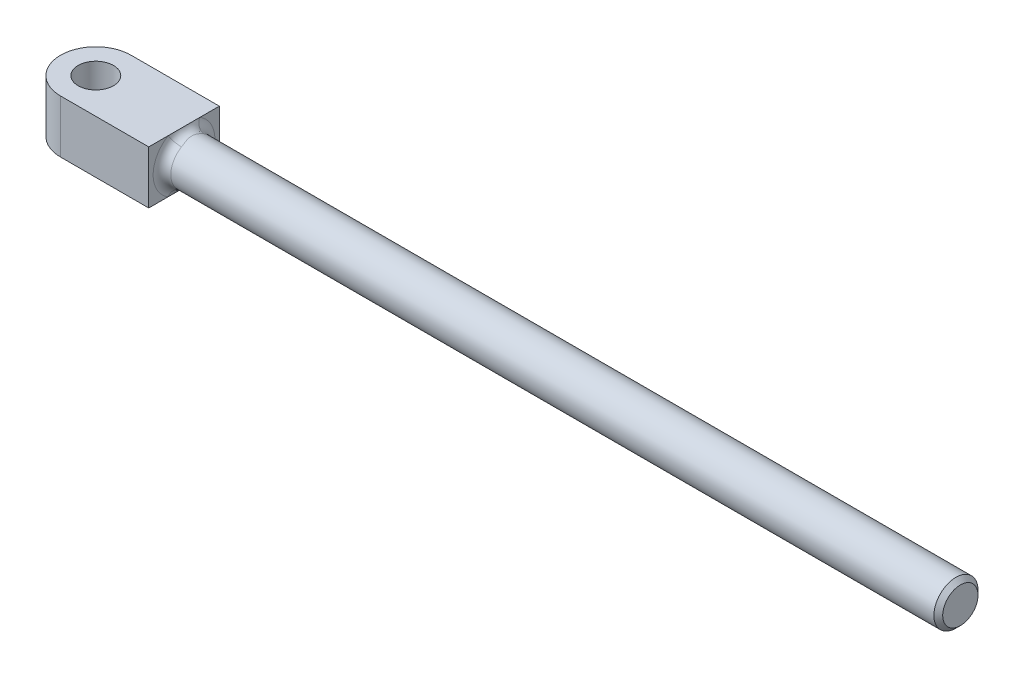
ISO-10303-21;
HEADER;
FILE_DESCRIPTION(('STEP AP214'),'2;1');
FILE_NAME('part.step','',(''),(''),'','','');
FILE_SCHEMA(('AUTOMOTIVE_DESIGN { 1 0 10303 214 1 1 1 1 }'));
ENDSEC;
DATA;
#1=APPLICATION_CONTEXT('core data for automotive mechanical design processes');
#2=APPLICATION_PROTOCOL_DEFINITION('international standard','automotive_design',2000,#1);
#3=PRODUCT_CONTEXT('',#1,'mechanical');
#4=PRODUCT('Part','Part','',(#3));
#5=PRODUCT_RELATED_PRODUCT_CATEGORY('part','',(#4));
#6=PRODUCT_DEFINITION_FORMATION('','',#4);
#7=PRODUCT_DEFINITION_CONTEXT('part definition',#1,'design');
#8=PRODUCT_DEFINITION('design','',#6,#7);
#9=PRODUCT_DEFINITION_SHAPE('','',#8);
#10=(LENGTH_UNIT() NAMED_UNIT(*) SI_UNIT(.MILLI.,.METRE.));
#11=(NAMED_UNIT(*) PLANE_ANGLE_UNIT() SI_UNIT($,.RADIAN.));
#12=(NAMED_UNIT(*) SI_UNIT($,.STERADIAN.) SOLID_ANGLE_UNIT());
#13=UNCERTAINTY_MEASURE_WITH_UNIT(LENGTH_MEASURE(1.E-05),#10,'distance_accuracy_value','');
#14=(GEOMETRIC_REPRESENTATION_CONTEXT(3) GLOBAL_UNCERTAINTY_ASSIGNED_CONTEXT((#13)) GLOBAL_UNIT_ASSIGNED_CONTEXT((#10,
#11,#12)) REPRESENTATION_CONTEXT('',''));
#15=CARTESIAN_POINT('',(0.,0.,0.));
#16=DIRECTION('',(0.,0.,1.));
#17=DIRECTION('',(1.,0.,0.));
#18=AXIS2_PLACEMENT_3D('',#15,#16,#17);
#19=CARTESIAN_POINT('',(-44.,3.,-3.99999999999999));
#20=DIRECTION('',(-1.,0.,0.));
#21=DIRECTION('',(0.,0.,1.));
#22=AXIS2_PLACEMENT_3D('',#19,#20,#21);
#23=PLANE('',#22);
#24=DIRECTION('',(0.,0.,-1.));
#25=VECTOR('',#24,1.);
#26=CARTESIAN_POINT('',(-44.,-3.,-3.99999999999999));
#27=LINE('',#26,#25);
#28=CARTESIAN_POINT('',(-44.,-3.,4.00000000000001));
#29=VERTEX_POINT('',#28);
#30=CARTESIAN_POINT('',(-44.,-3.,1.80277563773199));
#31=VERTEX_POINT('',#30);
#32=EDGE_CURVE('E235',#29,#31,#27,.T.);
#33=ORIENTED_EDGE('',*,*,#32,.T.);
#34=CARTESIAN_POINT('',(-44.,0.,0.));
#35=DIRECTION('',(-1.,0.,0.));
#36=DIRECTION('',(0.,0.,1.));
#37=AXIS2_PLACEMENT_3D('',#34,#35,#36);
#38=CIRCLE('',#37,3.5);
#39=CARTESIAN_POINT('',(-44.,3.,1.80277563773199));
#40=VERTEX_POINT('',#39);
#41=EDGE_CURVE('E63',#31,#40,#38,.T.);
#42=ORIENTED_EDGE('',*,*,#41,.T.);
#43=DIRECTION('',(0.,0.,-1.));
#44=VECTOR('',#43,1.);
#45=CARTESIAN_POINT('',(-44.,3.,-3.99999999999999));
#46=LINE('',#45,#44);
#47=CARTESIAN_POINT('',(-44.,3.,4.00000000000001));
#48=VERTEX_POINT('',#47);
#49=EDGE_CURVE('E115',#48,#40,#46,.T.);
#50=ORIENTED_EDGE('',*,*,#49,.F.);
#51=DIRECTION('',(0.,-1.,0.));
#52=VECTOR('',#51,1.);
#53=CARTESIAN_POINT('',(-44.,3.,4.00000000000001));
#54=LINE('',#53,#52);
#55=EDGE_CURVE('E237',#48,#29,#54,.T.);
#56=ORIENTED_EDGE('',*,*,#55,.T.);
#57=EDGE_LOOP('',(#33,#42,#50,#56));
#58=FACE_BOUND('',#57,.T.);
#59=ADVANCED_FACE('F40',(#58),#23,.F.);
#60=CARTESIAN_POINT('',(44.,0.,0.));
#61=DIRECTION('',(-1.,0.,0.));
#62=DIRECTION('',(0.,0.,1.));
#63=AXIS2_PLACEMENT_3D('',#60,#61,#62);
#64=CYLINDRICAL_SURFACE('',#63,2.5);
#65=CARTESIAN_POINT('',(43.5,0.,0.));
#66=DIRECTION('',(1.,0.,0.));
#67=DIRECTION('',(0.,0.,-1.));
#68=AXIS2_PLACEMENT_3D('',#65,#66,#67);
#69=CIRCLE('',#68,2.5);
#70=CARTESIAN_POINT('',(43.5,0.,-2.5));
#71=VERTEX_POINT('',#70);
#72=EDGE_CURVE('E11',#71,#71,#69,.F.);
#73=ORIENTED_EDGE('',*,*,#72,.T.);
#74=EDGE_LOOP('',(#73));
#75=FACE_BOUND('',#74,.T.);
#76=CARTESIAN_POINT('',(-43.,0.,0.));
#77=DIRECTION('',(-1.,0.,0.));
#78=DIRECTION('',(0.,0.,1.));
#79=AXIS2_PLACEMENT_3D('',#76,#77,#78);
#80=CIRCLE('',#79,2.5);
#81=CARTESIAN_POINT('',(-43.,2.14285714285714,1.28769688409428));
#82=VERTEX_POINT('',#81);
#83=CARTESIAN_POINT('',(-43.,-2.14285714285714,1.28769688409428));
#84=VERTEX_POINT('',#83);
#85=EDGE_CURVE('E129',#82,#84,#80,.F.);
#86=ORIENTED_EDGE('',*,*,#85,.T.);
#87=CARTESIAN_POINT('',(-43.089797118085,-1.84702666727615,1.68478262407076));
#88=CARTESIAN_POINT('',(-44.4013055840775,-2.11805305184009,1.38765648288614));
#89=CARTESIAN_POINT('',(-44.,-3.,2.35869567369906));
#90=CARTESIAN_POINT('',(-43.0750365677151,-1.87021882017818,1.65936827293122));
#91=CARTESIAN_POINT('',(-44.3701378909476,-2.10409965880878,1.39485788528736));
#92=CARTESIAN_POINT('',(-44.,-3.,2.32311558212301));
#93=CARTESIAN_POINT('',(-43.0624960551256,-1.8931706547633,1.63314087938531));
#94=CARTESIAN_POINT('',(-44.3378304890209,-2.09472768310196,1.39873123079868));
#95=CARTESIAN_POINT('',(-44.,-3.,2.28639723116133));
#96=CARTESIAN_POINT('',(-43.0413121648804,-1.93827997476055,1.57933264082472));
#97=CARTESIAN_POINT('',(-44.2739687568214,-2.08398106756867,1.3997411936574));
#98=CARTESIAN_POINT('',(-44.,-3.,2.21106569716945));
#99=CARTESIAN_POINT('',(-43.0326604969719,-1.96043905638494,1.55175481528735));
#100=CARTESIAN_POINT('',(-44.2424003619311,-2.08237228525282,1.39707606759514));
#101=CARTESIAN_POINT('',(-44.,-3.,2.1724567414075));
#102=CARTESIAN_POINT('',(-43.0118107698363,-2.02490711609745,1.46788389797563));
#103=CARTESIAN_POINT('',(-44.153160239198,-2.08663625544711,1.38007393620703));
#104=CARTESIAN_POINT('',(-44.,-3.,2.05503745715557));
#105=CARTESIAN_POINT('',(-43.00440526438,-2.06575259890433,1.40985814870029));
#106=CARTESIAN_POINT('',(-44.0973752365874,-2.10056168474141,1.35734706621003));
#107=CARTESIAN_POINT('',(-44.,-3.,1.97380140817703));
#108=CARTESIAN_POINT('',(-42.996699571837,-2.16653078185199,1.25280520925142));
#109=CARTESIAN_POINT('',(-43.971793247003,-2.1515106641981,1.27354998841386));
#110=CARTESIAN_POINT('',(-44.,-3.,1.75392729295749));
#111=CARTESIAN_POINT('',(-43.0038144970095,-2.22227780908099,1.15097658677616));
#112=CARTESIAN_POINT('',(-43.9094620246063,-2.19733566368004,1.19776380716157));
#113=CARTESIAN_POINT('',(-44.,-3.,1.61136722148821));
#114=CARTESIAN_POINT('',(-43.0285142350657,-2.31925618416504,0.940546919485254));
#115=CARTESIAN_POINT('',(-43.8178292510465,-2.28776397044253,1.01589565420034));
#116=CARTESIAN_POINT('',(-44.,-3.,1.31676568727775));
#117=CARTESIAN_POINT('',(-43.0461778500175,-2.36037452380379,0.831900466571035));
#118=CARTESIAN_POINT('',(-43.7862845207067,-2.3331242401296,0.909812051412252));
#119=CARTESIAN_POINT('',(-44.,-3.,1.1646606531986));
#120=CARTESIAN_POINT('',(-43.0731582535501,-2.41171212801429,0.661443155926707));
#121=CARTESIAN_POINT('',(-43.7528917245329,-2.39215410620666,0.73293320756347));
#122=CARTESIAN_POINT('',(-44.,-3.,0.926020418297847));
#123=CARTESIAN_POINT('',(-43.0825522109005,-2.4274223778965,0.601243759095351));
#124=CARTESIAN_POINT('',(-43.7439634770233,-2.41075944684108,0.66908859746001));
#125=CARTESIAN_POINT('',(-44.,-3.,0.841741262734434));
#126=CARTESIAN_POINT('',(-43.0998403341181,-2.45432605473146,0.479742938974906));
#127=CARTESIAN_POINT('',(-43.7300358645077,-2.44303860810299,0.538014598545595));
#128=CARTESIAN_POINT('',(-44.,-3.,0.671640114565432));
#129=CARTESIAN_POINT('',(-43.1077350515484,-2.46552114449967,0.418441930084296));
#130=CARTESIAN_POINT('',(-43.7249453148161,-2.45686188645873,0.470525326937772));
#131=CARTESIAN_POINT('',(-44.,-3.,0.585818702117714));
#132=CARTESIAN_POINT('',(-43.1207588796569,-2.483274322633,0.295297174727514));
#133=CARTESIAN_POINT('',(-43.7174407917484,-2.47886682684453,0.333738205015885));
#134=CARTESIAN_POINT('',(-44.,-3.,0.41341604461882));
#135=CARTESIAN_POINT('',(-43.1259001064712,-2.48985276592177,0.23345704344554));
#136=CARTESIAN_POINT('',(-43.7149720886307,-2.48717845577119,0.264142380679068));
#137=CARTESIAN_POINT('',(-44.,-3.,0.326839860825512));
#138=CARTESIAN_POINT('',(-43.1326423774325,-2.49838093998099,0.109361414969622));
#139=CARTESIAN_POINT('',(-43.7118654798941,-2.49792896303268,0.124128201815237));
#140=CARTESIAN_POINT('',(-44.,-3.,0.15310598095591));
#141=CARTESIAN_POINT('',(-43.134243770003,-2.50033112630897,0.0471059592608588));
#142=CARTESIAN_POINT('',(-43.7112114325808,-2.5004215525342,0.053369086200987));
#143=CARTESIAN_POINT('',(-44.,-3.,0.0659483429588708));
#144=CARTESIAN_POINT('',(-43.1336139067538,-2.49955575223616,-0.0809249677260376));
#145=CARTESIAN_POINT('',(-43.7114774751147,-2.4994348313836,-0.0917267287856808));
#146=CARTESIAN_POINT('',(-44.,-3.,-0.11329495480976));
#147=CARTESIAN_POINT('',(-43.1311586456095,-2.49655692159848,-0.146698507289059));
#148=CARTESIAN_POINT('',(-43.7124911460776,-2.49560052172953,-0.166438542504345));
#149=CARTESIAN_POINT('',(-44.,-3.,-0.205377910178892));
#150=CARTESIAN_POINT('',(-43.1224512074842,-2.48540146107993,-0.277672408532116));
#151=CARTESIAN_POINT('',(-43.716666788324,-2.48158959625075,-0.313859143066439));
#152=CARTESIAN_POINT('',(-44.,-3.,-0.388741371970758));
#153=CARTESIAN_POINT('',(-43.1161982583954,-2.47724378233976,-0.34287265091976));
#154=CARTESIAN_POINT('',(-43.7198536950069,-2.4713346985524,-0.38696412992512));
#155=CARTESIAN_POINT('',(-44.,-3.,-0.480021711384163));
#156=CARTESIAN_POINT('',(-43.0932464010228,-2.44504355931936,-0.537749623298509));
#157=CARTESIAN_POINT('',(-43.7342534174093,-2.4313991285767,-0.603266803000684));
#158=CARTESIAN_POINT('',(-44.,-3.,-0.752849472792696));
#159=CARTESIAN_POINT('',(-43.0723789849322,-2.4132798538366,-0.665936276663973));
#160=CARTESIAN_POINT('',(-43.7505706277765,-2.39210640783797,-0.742186068976914));
#161=CARTESIAN_POINT('',(-44.,-3.,-0.932310787375736));
#162=CARTESIAN_POINT('',(-43.0325989277867,-2.32918194316109,-0.918065057160651));
#163=CARTESIAN_POINT('',(-43.8098708915164,-2.29892237927612,-0.99519210121178));
#164=CARTESIAN_POINT('',(-44.,-3.,-1.28529107997797));
#165=CARTESIAN_POINT('',(-43.01372459553,-2.27651421506208,-1.04190105099422));
#166=CARTESIAN_POINT('',(-43.8552965844584,-2.24305314597983,-1.1102563906792));
#167=CARTESIAN_POINT('',(-44.,-3.,-1.45866147138323));
#168=CARTESIAN_POINT('',(-43.0006561131893,-2.18316948515407,-1.21991874616669));
#169=CARTESIAN_POINT('',(-43.9527001394436,-2.16884641960792,-1.2448598848791));
#170=CARTESIAN_POINT('',(-44.,-3.,-1.70788624463767));
#171=CARTESIAN_POINT('',(-42.9988115884042,-2.149871023253,-1.27769153842257));
#172=CARTESIAN_POINT('',(-43.9914812930602,-2.145083791615,-1.28423049414726));
#173=CARTESIAN_POINT('',(-44.,-3.,-1.78876815379295));
#174=CARTESIAN_POINT('',(-43.0027809524236,-2.0788450920917,-1.39025899402648));
#175=CARTESIAN_POINT('',(-44.0802128203742,-2.10631330259421,-1.34781643223735));
#176=CARTESIAN_POINT('',(-44.,-3.,-1.94636259163616));
#177=CARTESIAN_POINT('',(-43.0085821638041,-2.04112504867187,-1.445058430778));
#178=CARTESIAN_POINT('',(-44.1308276829839,-2.09160274518386,-1.37150981875896));
#179=CARTESIAN_POINT('',(-44.,-3.,-2.02308180308897));
#180=CARTESIAN_POINT('',(-43.0287135788627,-1.96987321995235,-1.54025161223537));
#181=CARTESIAN_POINT('',(-44.2293462180589,-2.08120077433799,-1.39659640419796));
#182=CARTESIAN_POINT('',(-44.,-3.,-2.1563522571297));
#183=CARTESIAN_POINT('',(-43.0411101719168,-1.93700833370554,-1.58133744408649));
#184=CARTESIAN_POINT('',(-44.2764809877482,-2.08277430752351,-1.40104255573381));
#185=CARTESIAN_POINT('',(-44.,-3.,-2.21387242172118));
#186=CARTESIAN_POINT('',(-43.0748140684746,-1.86941106524606,-1.66075648332885));
#187=CARTESIAN_POINT('',(-44.3718312861369,-2.10297416756328,-1.39609191158888));
#188=CARTESIAN_POINT('',(-44.,-3.,-2.3250590766603));
#189=CARTESIAN_POINT('',(-43.0962198088155,-1.83466186451648,-1.69905362584828));
#190=CARTESIAN_POINT('',(-44.4200246778576,-2.12254536468005,-1.38591811782259));
#191=CARTESIAN_POINT('',(-44.,-3.,-2.37867507618739));
#192=CARTESIAN_POINT('',(-43.1230308972261,-1.7996094539966,-1.73534025859082));
#193=CARTESIAN_POINT('',(-44.4637953692632,-2.1536011914318,-1.36823825990707));
#194=CARTESIAN_POINT('',(-44.,-3.,-2.42947636202715));
#195=(BOUNDED_SURFACE() B_SPLINE_SURFACE(3,2,((#87,#88,#89),(#90,#91,#92),(#93,#94,#95),(#96,
#97,#98),(#99,#100,#101),(#102,#103,#104),(#105,#106,#107),(#108,#109,#110),(#111,#112,#113),
(#114,#115,#116),(#117,#118,#119),(#120,#121,#122),(#123,#124,#125),(#126,#127,#128),(#129,#130,
#131),(#132,#133,#134),(#135,#136,#137),(#138,#139,#140),(#141,#142,#143),(#144,#145,#146),
(#147,#148,#149),(#150,#151,#152),(#153,#154,#155),(#156,#157,#158),(#159,#160,#161),(#162,#163,
#164),(#165,#166,#167),(#168,#169,#170),(#171,#172,#173),(#174,#175,#176),(#177,#178,#179),
(#180,#181,#182),(#183,#184,#185),(#186,#187,#188),(#189,#190,#191),(#192,#193,#194)),
.UNSPECIFIED.,.F.,.F.,.F.) B_SPLINE_SURFACE_WITH_KNOTS((4,2,2,2,2,2,2,2,2,2,2,2,2,2,2,2,2,4),(3,
3),(0.,0.150978452111826,0.301633503365175,0.599468504271149,1.08493079559652,1.5740658222736,
1.83667758241671,2.09919254100669,2.36054266600819,2.62186706535213,2.89810917700128,
3.17440747024342,3.73017973784789,4.29520076320605,4.57485505395894,4.85404623174447,
5.0775082098356,5.30347792971451),(0.,1.),
.UNSPECIFIED.) GEOMETRIC_REPRESENTATION_ITEM() RATIONAL_B_SPLINE_SURFACE(((1.,0.58907223863504,
1.),(1.,0.597621981679868,1.),(1.,0.60628107213765,1.),(1.,0.623622640940449,1.),(1.,
0.632305029457277,1.),(1.,0.657952795370195,1.),(1.,0.674723639585425,1.),(1.,0.716899899837879,
1.),(1.,0.74108911560171,1.),(1.,0.783806931119418,1.),(1.,0.802291321337427,1.),(1.,
0.825548340664816,1.),(1.,0.832706660558894,1.),(1.,0.845003938290569,1.),(1.,0.850143639514369,
1.),(1.,0.858307963303754,1.),(1.,0.861341869719555,1.),(1.,0.865276991795517,1.),(1.,
0.866178417354906,1.),(1.,0.865820137657809,1.),(1.,0.864434126698027,1.),(1.,0.85928990934619,
1.),(1.,0.855531220558888,1.),(1.,0.840741031559036,1.),(1.,0.826198716210334,1.),(1.,
0.788270185201534,1.),(1.,0.764740823018138,1.),(1.,0.724264523444221,1.),(1.,0.709994983454136,
1.),(1.,0.680153160391981,1.),(1.,0.664583073820695,1.),(1.,0.63597985940237,1.),(1.,
0.623060704128204,1.),(1.,0.597254296383171,1.),(1.,0.584369028951347,1.),(1.,0.571874723989392,1.))) REPRESENTATION_ITEM('') SURFACE());
#196=CARTESIAN_POINT('',(-43.089797118085,-1.84702666727615,1.68478262407076));
#197=CARTESIAN_POINT('',(-43.0750365677151,-1.87021882017818,1.65936827293122));
#198=CARTESIAN_POINT('',(-43.0624960551256,-1.8931706547633,1.63314087938531));
#199=CARTESIAN_POINT('',(-43.0413121648804,-1.93827997476055,1.57933264082472));
#200=CARTESIAN_POINT('',(-43.0326604969719,-1.96043905638494,1.55175481528735));
#201=CARTESIAN_POINT('',(-43.0118107698362,-2.02490711609745,1.46788389797563));
#202=CARTESIAN_POINT('',(-43.00440526438,-2.06575259890433,1.40985814870029));
#203=CARTESIAN_POINT('',(-42.996699571837,-2.16653078185199,1.25280520925142));
#204=CARTESIAN_POINT('',(-43.0038144970095,-2.22227780908099,1.15097658677616));
#205=CARTESIAN_POINT('',(-43.0285142350657,-2.31925618416504,0.940546919485254));
#206=CARTESIAN_POINT('',(-43.0461778500175,-2.36037452380379,0.831900466571035));
#207=CARTESIAN_POINT('',(-43.0731582535501,-2.41171212801429,0.661443155926707));
#208=CARTESIAN_POINT('',(-43.0825522109005,-2.4274223778965,0.601243759095351));
#209=CARTESIAN_POINT('',(-43.0998403341181,-2.45432605473146,0.479742938974906));
#210=CARTESIAN_POINT('',(-43.1077350515484,-2.46552114449967,0.418441930084296));
#211=CARTESIAN_POINT('',(-43.1207588796569,-2.483274322633,0.295297174727514));
#212=CARTESIAN_POINT('',(-43.1259001064712,-2.48985276592177,0.23345704344554));
#213=CARTESIAN_POINT('',(-43.1326423774325,-2.49838093998099,0.109361414969622));
#214=CARTESIAN_POINT('',(-43.134243770003,-2.50033112630897,0.0471059592608588));
#215=CARTESIAN_POINT('',(-43.1336139067538,-2.49955575223616,-0.0809249677260375));
#216=CARTESIAN_POINT('',(-43.1311586456095,-2.49655692159848,-0.146698507289059));
#217=CARTESIAN_POINT('',(-43.1224512074842,-2.48540146107993,-0.277672408532116));
#218=CARTESIAN_POINT('',(-43.1161982583954,-2.47724378233976,-0.34287265091976));
#219=CARTESIAN_POINT('',(-43.0932464010228,-2.44504355931936,-0.537749623298509));
#220=CARTESIAN_POINT('',(-43.0723789849322,-2.4132798538366,-0.665936276663973));
#221=CARTESIAN_POINT('',(-43.0325989277867,-2.32918194316109,-0.918065057160651));
#222=CARTESIAN_POINT('',(-43.01372459553,-2.27651421506208,-1.04190105099422));
#223=CARTESIAN_POINT('',(-43.0006561131893,-2.18316948515407,-1.21991874616669));
#224=CARTESIAN_POINT('',(-42.9988115884042,-2.149871023253,-1.27769153842257));
#225=CARTESIAN_POINT('',(-43.0027809524236,-2.0788450920917,-1.39025899402648));
#226=CARTESIAN_POINT('',(-43.0085821638041,-2.04112504867187,-1.445058430778));
#227=CARTESIAN_POINT('',(-43.0287135788627,-1.96987321995235,-1.54025161223537));
#228=CARTESIAN_POINT('',(-43.0411101719168,-1.93700833370554,-1.58133744408649));
#229=CARTESIAN_POINT('',(-43.0748140684746,-1.86941106524606,-1.66075648332885));
#230=CARTESIAN_POINT('',(-43.0962198088155,-1.83466186451648,-1.69905362584828));
#231=CARTESIAN_POINT('',(-43.1230308972261,-1.7996094539966,-1.73534025859082));
#232=B_SPLINE_CURVE_WITH_KNOTS('',3,(#196,#197,#198,#199,#200,#201,#202,#203,#204,#205,#206,
#207,#208,#209,#210,#211,#212,#213,#214,#215,#216,#217,#218,#219,#220,#221,#222,#223,#224,#225,
#226,#227,#228,#229,#230,#231),.UNSPECIFIED.,.F.,.F.,(4,2,2,2,2,2,2,2,2,2,2,2,2,2,2,2,2,4),(0.,
0.150978452111826,0.301633503365175,0.599468504271149,1.08493079559652,1.5740658222736,
1.83667758241671,2.09919254100669,2.36054266600819,2.62186706535213,2.89810917700128,
3.17440747024342,3.73017973784789,4.29520076320605,4.57485505395894,4.85404623174447,
5.0775082098356,5.30347792971451),.UNSPECIFIED.);
#233=CARTESIAN_POINT('',(-43.,-2.14285714285714,-1.28769688409428));
#234=VERTEX_POINT('',#233);
#235=EDGE_CURVE('E183',#84,#234,#232,.T.);
#236=ORIENTED_EDGE('',*,*,#235,.T.);
#237=CARTESIAN_POINT('',(-43.,0.,0.));
#238=DIRECTION('',(-1.,0.,0.));
#239=DIRECTION('',(0.,0.,1.));
#240=AXIS2_PLACEMENT_3D('',#237,#238,#239);
#241=CIRCLE('',#240,2.5);
#242=CARTESIAN_POINT('',(-43.,2.14285714285714,-1.28769688409428));
#243=VERTEX_POINT('',#242);
#244=EDGE_CURVE('E144',#234,#243,#241,.F.);
#245=ORIENTED_EDGE('',*,*,#244,.T.);
#246=CARTESIAN_POINT('',(-43.089797118085,1.84702666727615,-1.68478262407076));
#247=CARTESIAN_POINT('',(-44.4013055840775,2.11805305184009,-1.38765648288614));
#248=CARTESIAN_POINT('',(-44.,3.,-2.35869567369906));
#249=CARTESIAN_POINT('',(-43.0750365677151,1.87021882017818,-1.65936827293122));
#250=CARTESIAN_POINT('',(-44.3701378909476,2.10409965880878,-1.39485788528736));
#251=CARTESIAN_POINT('',(-44.,3.,-2.32311558212301));
#252=CARTESIAN_POINT('',(-43.0624960551256,1.8931706547633,-1.63314087938531));
#253=CARTESIAN_POINT('',(-44.3378304890209,2.09472768310196,-1.39873123079867));
#254=CARTESIAN_POINT('',(-44.,3.,-2.28639723116133));
#255=CARTESIAN_POINT('',(-43.0413121648804,1.93827997476055,-1.57933264082472));
#256=CARTESIAN_POINT('',(-44.2739687568214,2.08398106756867,-1.39974119365739));
#257=CARTESIAN_POINT('',(-44.,3.,-2.21106569716945));
#258=CARTESIAN_POINT('',(-43.0326604969719,1.96043905638494,-1.55175481528735));
#259=CARTESIAN_POINT('',(-44.2424003619311,2.08237228525282,-1.39707606759514));
#260=CARTESIAN_POINT('',(-44.,3.,-2.1724567414075));
#261=CARTESIAN_POINT('',(-43.0118107698363,2.02490711609745,-1.46788389797563));
#262=CARTESIAN_POINT('',(-44.153160239198,2.08663625544711,-1.38007393620703));
#263=CARTESIAN_POINT('',(-44.,3.,-2.05503745715557));
#264=CARTESIAN_POINT('',(-43.00440526438,2.06575259890433,-1.40985814870029));
#265=CARTESIAN_POINT('',(-44.0973752365874,2.10056168474141,-1.35734706621003));
#266=CARTESIAN_POINT('',(-44.,3.,-1.97380140817703));
#267=CARTESIAN_POINT('',(-42.996699571837,2.16653078185199,-1.25280520925142));
#268=CARTESIAN_POINT('',(-43.971793247003,2.1515106641981,-1.27354998841386));
#269=CARTESIAN_POINT('',(-44.,3.,-1.75392729295749));
#270=CARTESIAN_POINT('',(-43.0038144970095,2.22227780908099,-1.15097658677616));
#271=CARTESIAN_POINT('',(-43.9094620246063,2.19733566368004,-1.19776380716157));
#272=CARTESIAN_POINT('',(-44.,3.,-1.61136722148821));
#273=CARTESIAN_POINT('',(-43.0285142350657,2.31925618416504,-0.940546919485254));
#274=CARTESIAN_POINT('',(-43.8178292510465,2.28776397044253,-1.01589565420034));
#275=CARTESIAN_POINT('',(-44.,3.,-1.31676568727775));
#276=CARTESIAN_POINT('',(-43.0461778500175,2.36037452380379,-0.831900466571035));
#277=CARTESIAN_POINT('',(-43.7862845207067,2.3331242401296,-0.909812051412252));
#278=CARTESIAN_POINT('',(-44.,3.,-1.1646606531986));
#279=CARTESIAN_POINT('',(-43.0731582535501,2.41171212801429,-0.661443155926707));
#280=CARTESIAN_POINT('',(-43.7528917245329,2.39215410620666,-0.73293320756347));
#281=CARTESIAN_POINT('',(-44.,3.,-0.926020418297847));
#282=CARTESIAN_POINT('',(-43.0825522109005,2.4274223778965,-0.601243759095351));
#283=CARTESIAN_POINT('',(-43.7439634770233,2.41075944684108,-0.66908859746001));
#284=CARTESIAN_POINT('',(-44.,3.,-0.841741262734434));
#285=CARTESIAN_POINT('',(-43.0998403341181,2.45432605473146,-0.479742938974906));
#286=CARTESIAN_POINT('',(-43.7300358645077,2.44303860810299,-0.538014598545595));
#287=CARTESIAN_POINT('',(-44.,3.,-0.671640114565432));
#288=CARTESIAN_POINT('',(-43.1077350515484,2.46552114449967,-0.418441930084296));
#289=CARTESIAN_POINT('',(-43.7249453148161,2.45686188645873,-0.470525326937772));
#290=CARTESIAN_POINT('',(-44.,3.,-0.585818702117714));
#291=CARTESIAN_POINT('',(-43.1207588796569,2.483274322633,-0.295297174727514));
#292=CARTESIAN_POINT('',(-43.7174407917484,2.47886682684453,-0.333738205015885));
#293=CARTESIAN_POINT('',(-44.,3.,-0.41341604461882));
#294=CARTESIAN_POINT('',(-43.1259001064712,2.48985276592177,-0.23345704344554));
#295=CARTESIAN_POINT('',(-43.7149720886307,2.48717845577119,-0.264142380679068));
#296=CARTESIAN_POINT('',(-44.,3.,-0.326839860825512));
#297=CARTESIAN_POINT('',(-43.1326423774325,2.49838093998099,-0.109361414969622));
#298=CARTESIAN_POINT('',(-43.7118654798941,2.49792896303268,-0.124128201815237));
#299=CARTESIAN_POINT('',(-44.,3.,-0.15310598095591));
#300=CARTESIAN_POINT('',(-43.134243770003,2.50033112630897,-0.0471059592608588));
#301=CARTESIAN_POINT('',(-43.7112114325808,2.5004215525342,-0.053369086200987));
#302=CARTESIAN_POINT('',(-44.,3.,-0.0659483429588708));
#303=CARTESIAN_POINT('',(-43.1336139067538,2.49955575223616,0.0809249677260376));
#304=CARTESIAN_POINT('',(-43.7114774751147,2.4994348313836,0.0917267287856808));
#305=CARTESIAN_POINT('',(-44.,3.,0.11329495480976));
#306=CARTESIAN_POINT('',(-43.1311586456095,2.49655692159848,0.146698507289059));
#307=CARTESIAN_POINT('',(-43.7124911460776,2.49560052172953,0.166438542504345));
#308=CARTESIAN_POINT('',(-44.,3.,0.205377910178892));
#309=CARTESIAN_POINT('',(-43.1224512074842,2.48540146107993,0.277672408532116));
#310=CARTESIAN_POINT('',(-43.716666788324,2.48158959625075,0.313859143066439));
#311=CARTESIAN_POINT('',(-44.,3.,0.388741371970758));
#312=CARTESIAN_POINT('',(-43.1161982583954,2.47724378233976,0.34287265091976));
#313=CARTESIAN_POINT('',(-43.7198536950069,2.4713346985524,0.38696412992512));
#314=CARTESIAN_POINT('',(-44.,3.,0.480021711384163));
#315=CARTESIAN_POINT('',(-43.0932464010228,2.44504355931936,0.537749623298509));
#316=CARTESIAN_POINT('',(-43.7342534174093,2.4313991285767,0.603266803000684));
#317=CARTESIAN_POINT('',(-44.,3.,0.752849472792696));
#318=CARTESIAN_POINT('',(-43.0723789849322,2.4132798538366,0.665936276663973));
#319=CARTESIAN_POINT('',(-43.7505706277765,2.39210640783797,0.742186068976914));
#320=CARTESIAN_POINT('',(-44.,3.,0.932310787375736));
#321=CARTESIAN_POINT('',(-43.0325989277867,2.32918194316109,0.918065057160651));
#322=CARTESIAN_POINT('',(-43.8098708915164,2.29892237927612,0.99519210121178));
#323=CARTESIAN_POINT('',(-44.,3.,1.28529107997797));
#324=CARTESIAN_POINT('',(-43.01372459553,2.27651421506208,1.04190105099422));
#325=CARTESIAN_POINT('',(-43.8552965844584,2.24305314597983,1.1102563906792));
#326=CARTESIAN_POINT('',(-44.,3.,1.45866147138323));
#327=CARTESIAN_POINT('',(-43.0006561131893,2.18316948515407,1.21991874616669));
#328=CARTESIAN_POINT('',(-43.9527001394436,2.16884641960792,1.2448598848791));
#329=CARTESIAN_POINT('',(-44.,3.,1.70788624463767));
#330=CARTESIAN_POINT('',(-42.9988115884042,2.149871023253,1.27769153842257));
#331=CARTESIAN_POINT('',(-43.9914812930602,2.145083791615,1.28423049414726));
#332=CARTESIAN_POINT('',(-44.,3.,1.78876815379295));
#333=CARTESIAN_POINT('',(-43.0027809524236,2.0788450920917,1.39025899402648));
#334=CARTESIAN_POINT('',(-44.0802128203742,2.10631330259421,1.34781643223736));
#335=CARTESIAN_POINT('',(-44.,3.,1.94636259163616));
#336=CARTESIAN_POINT('',(-43.0085821638041,2.04112504867187,1.445058430778));
#337=CARTESIAN_POINT('',(-44.1308276829839,2.09160274518386,1.37150981875896));
#338=CARTESIAN_POINT('',(-44.,3.,2.02308180308897));
#339=CARTESIAN_POINT('',(-43.0287135788627,1.96987321995235,1.54025161223537));
#340=CARTESIAN_POINT('',(-44.2293462180589,2.08120077433799,1.39659640419796));
#341=CARTESIAN_POINT('',(-44.,3.,2.1563522571297));
#342=CARTESIAN_POINT('',(-43.0411101719168,1.93700833370554,1.58133744408649));
#343=CARTESIAN_POINT('',(-44.2764809877482,2.08277430752351,1.40104255573381));
#344=CARTESIAN_POINT('',(-44.,3.,2.21387242172117));
#345=CARTESIAN_POINT('',(-43.0748140684746,1.86941106524606,1.66075648332885));
#346=CARTESIAN_POINT('',(-44.3718312861369,2.10297416756328,1.39609191158888));
#347=CARTESIAN_POINT('',(-44.,3.,2.3250590766603));
#348=CARTESIAN_POINT('',(-43.0962198088155,1.83466186451648,1.69905362584828));
#349=CARTESIAN_POINT('',(-44.4200246778576,2.12254536468005,1.38591811782259));
#350=CARTESIAN_POINT('',(-44.,3.,2.37867507618739));
#351=CARTESIAN_POINT('',(-43.1230308972261,1.7996094539966,1.73534025859082));
#352=CARTESIAN_POINT('',(-44.4637953692632,2.1536011914318,1.36823825990707));
#353=CARTESIAN_POINT('',(-44.,3.,2.42947636202715));
#354=(BOUNDED_SURFACE() B_SPLINE_SURFACE(3,2,((#246,#247,#248),(#249,#250,#251),(#252,#253,
#254),(#255,#256,#257),(#258,#259,#260),(#261,#262,#263),(#264,#265,#266),(#267,#268,#269),
(#270,#271,#272),(#273,#274,#275),(#276,#277,#278),(#279,#280,#281),(#282,#283,#284),(#285,#286,
#287),(#288,#289,#290),(#291,#292,#293),(#294,#295,#296),(#297,#298,#299),(#300,#301,#302),
(#303,#304,#305),(#306,#307,#308),(#309,#310,#311),(#312,#313,#314),(#315,#316,#317),(#318,#319,
#320),(#321,#322,#323),(#324,#325,#326),(#327,#328,#329),(#330,#331,#332),(#333,#334,#335),
(#336,#337,#338),(#339,#340,#341),(#342,#343,#344),(#345,#346,#347),(#348,#349,#350),(#351,#352,
#353)),.UNSPECIFIED.,.F.,.F.,.F.) B_SPLINE_SURFACE_WITH_KNOTS((4,2,2,2,2,2,2,2,2,2,2,2,2,2,2,2,
2,4),(3,3),(0.,0.150978452111826,0.301633503365175,0.599468504271149,1.08493079559652,
1.5740658222736,1.83667758241671,2.09919254100669,2.36054266600819,2.62186706535213,
2.89810917700128,3.17440747024342,3.73017973784789,4.29520076320605,4.57485505395894,
4.85404623174447,5.0775082098356,5.30347792971451),(0.,1.),
.UNSPECIFIED.) GEOMETRIC_REPRESENTATION_ITEM() RATIONAL_B_SPLINE_SURFACE(((1.,0.58907223863504,
1.),(1.,0.597621981679868,1.),(1.,0.60628107213765,1.),(1.,0.62362264094045,1.),(1.,
0.632305029457277,1.),(1.,0.657952795370195,1.),(1.,0.674723639585425,1.),(1.,0.716899899837879,
1.),(1.,0.74108911560171,1.),(1.,0.783806931119418,1.),(1.,0.802291321337427,1.),(1.,
0.825548340664816,1.),(1.,0.832706660558894,1.),(1.,0.845003938290569,1.),(1.,0.850143639514369,
1.),(1.,0.858307963303754,1.),(1.,0.861341869719555,1.),(1.,0.865276991795517,1.),(1.,
0.866178417354906,1.),(1.,0.865820137657809,1.),(1.,0.864434126698027,1.),(1.,0.85928990934619,
1.),(1.,0.855531220558888,1.),(1.,0.840741031559036,1.),(1.,0.826198716210334,1.),(1.,
0.788270185201534,1.),(1.,0.764740823018138,1.),(1.,0.724264523444221,1.),(1.,0.709994983454136,
1.),(1.,0.680153160391981,1.),(1.,0.664583073820695,1.),(1.,0.635979859402369,1.),(1.,
0.623060704128204,1.),(1.,0.597254296383171,1.),(1.,0.584369028951347,1.),(1.,0.571874723989392,1.))) REPRESENTATION_ITEM('') SURFACE());
#355=CARTESIAN_POINT('',(-43.089797118085,1.84702666727615,-1.68478262407076));
#356=CARTESIAN_POINT('',(-43.0750365677151,1.87021882017818,-1.65936827293122));
#357=CARTESIAN_POINT('',(-43.0624960551256,1.8931706547633,-1.63314087938531));
#358=CARTESIAN_POINT('',(-43.0413121648804,1.93827997476055,-1.57933264082472));
#359=CARTESIAN_POINT('',(-43.0326604969719,1.96043905638494,-1.55175481528735));
#360=CARTESIAN_POINT('',(-43.0118107698362,2.02490711609745,-1.46788389797563));
#361=CARTESIAN_POINT('',(-43.00440526438,2.06575259890433,-1.40985814870029));
#362=CARTESIAN_POINT('',(-42.996699571837,2.16653078185199,-1.25280520925142));
#363=CARTESIAN_POINT('',(-43.0038144970095,2.22227780908099,-1.15097658677616));
#364=CARTESIAN_POINT('',(-43.0285142350657,2.31925618416504,-0.940546919485254));
#365=CARTESIAN_POINT('',(-43.0461778500175,2.36037452380379,-0.831900466571035));
#366=CARTESIAN_POINT('',(-43.0731582535501,2.41171212801429,-0.661443155926707));
#367=CARTESIAN_POINT('',(-43.0825522109005,2.4274223778965,-0.601243759095351));
#368=CARTESIAN_POINT('',(-43.0998403341181,2.45432605473146,-0.479742938974906));
#369=CARTESIAN_POINT('',(-43.1077350515484,2.46552114449967,-0.418441930084296));
#370=CARTESIAN_POINT('',(-43.1207588796569,2.483274322633,-0.295297174727514));
#371=CARTESIAN_POINT('',(-43.1259001064712,2.48985276592177,-0.23345704344554));
#372=CARTESIAN_POINT('',(-43.1326423774325,2.49838093998099,-0.109361414969622));
#373=CARTESIAN_POINT('',(-43.134243770003,2.50033112630897,-0.0471059592608588));
#374=CARTESIAN_POINT('',(-43.1336139067538,2.49955575223616,0.0809249677260375));
#375=CARTESIAN_POINT('',(-43.1311586456095,2.49655692159848,0.146698507289059));
#376=CARTESIAN_POINT('',(-43.1224512074842,2.48540146107993,0.277672408532116));
#377=CARTESIAN_POINT('',(-43.1161982583954,2.47724378233976,0.34287265091976));
#378=CARTESIAN_POINT('',(-43.0932464010228,2.44504355931936,0.537749623298509));
#379=CARTESIAN_POINT('',(-43.0723789849322,2.4132798538366,0.665936276663973));
#380=CARTESIAN_POINT('',(-43.0325989277867,2.32918194316109,0.918065057160651));
#381=CARTESIAN_POINT('',(-43.01372459553,2.27651421506208,1.04190105099422));
#382=CARTESIAN_POINT('',(-43.0006561131893,2.18316948515407,1.21991874616669));
#383=CARTESIAN_POINT('',(-42.9988115884042,2.149871023253,1.27769153842257));
#384=CARTESIAN_POINT('',(-43.0027809524236,2.0788450920917,1.39025899402648));
#385=CARTESIAN_POINT('',(-43.0085821638041,2.04112504867187,1.445058430778));
#386=CARTESIAN_POINT('',(-43.0287135788627,1.96987321995235,1.54025161223537));
#387=CARTESIAN_POINT('',(-43.0411101719168,1.93700833370554,1.58133744408649));
#388=CARTESIAN_POINT('',(-43.0748140684746,1.86941106524606,1.66075648332885));
#389=CARTESIAN_POINT('',(-43.0962198088155,1.83466186451648,1.69905362584828));
#390=CARTESIAN_POINT('',(-43.1230308972261,1.7996094539966,1.73534025859082));
#391=B_SPLINE_CURVE_WITH_KNOTS('',3,(#355,#356,#357,#358,#359,#360,#361,#362,#363,#364,#365,
#366,#367,#368,#369,#370,#371,#372,#373,#374,#375,#376,#377,#378,#379,#380,#381,#382,#383,#384,
#385,#386,#387,#388,#389,#390),.UNSPECIFIED.,.F.,.F.,(4,2,2,2,2,2,2,2,2,2,2,2,2,2,2,2,2,4),(0.,
0.150978452111826,0.301633503365175,0.599468504271149,1.08493079559652,1.5740658222736,
1.83667758241671,2.09919254100669,2.36054266600819,2.62186706535213,2.89810917700128,
3.17440747024342,3.73017973784789,4.29520076320605,4.57485505395894,4.85404623174447,
5.0775082098356,5.30347792971451),.UNSPECIFIED.);
#392=EDGE_CURVE('E131',#243,#82,#391,.T.);
#393=ORIENTED_EDGE('',*,*,#392,.T.);
#394=EDGE_LOOP('',(#86,#236,#245,#393));
#395=FACE_BOUND('',#394,.T.);
#396=ADVANCED_FACE('F146',(#75,#395),#64,.T.);
#397=CARTESIAN_POINT('',(44.,0.,0.));
#398=DIRECTION('',(1.,0.,0.));
#399=DIRECTION('',(0.,0.,-1.));
#400=AXIS2_PLACEMENT_3D('',#397,#398,#399);
#401=PLANE('',#400);
#402=CARTESIAN_POINT('',(44.,0.,0.));
#403=DIRECTION('',(1.,0.,0.));
#404=DIRECTION('',(0.,0.,-1.));
#405=AXIS2_PLACEMENT_3D('',#402,#403,#404);
#406=CIRCLE('',#405,2.);
#407=CARTESIAN_POINT('',(44.,0.,-2.));
#408=VERTEX_POINT('',#407);
#409=EDGE_CURVE('E48',#408,#408,#406,.T.);
#410=ORIENTED_EDGE('',*,*,#409,.T.);
#411=EDGE_LOOP('',(#410));
#412=FACE_BOUND('',#411,.T.);
#413=ADVANCED_FACE('F231',(#412),#401,.T.);
#414=CARTESIAN_POINT('',(-54.,3.,0.));
#415=DIRECTION('',(0.,1.,0.));
#416=DIRECTION('',(0.,0.,1.));
#417=AXIS2_PLACEMENT_3D('',#414,#415,#416);
#418=PLANE('',#417);
#419=ORIENTED_EDGE('',*,*,#49,.T.);
#420=CARTESIAN_POINT('',(-44.,3.,-1.80277563773199));
#421=VERTEX_POINT('',#420);
#422=EDGE_CURVE('E111',#40,#421,#46,.T.);
#423=ORIENTED_EDGE('',*,*,#422,.T.);
#424=CARTESIAN_POINT('',(-44.,3.,-3.99999999999999));
#425=VERTEX_POINT('',#424);
#426=EDGE_CURVE('E55',#421,#425,#46,.T.);
#427=ORIENTED_EDGE('',*,*,#426,.T.);
#428=DIRECTION('',(-1.,0.,0.));
#429=VECTOR('',#428,1.);
#430=CARTESIAN_POINT('',(-44.,3.,-3.99999999999999));
#431=LINE('',#430,#429);
#432=CARTESIAN_POINT('',(-54.,3.,-3.99999999999999));
#433=VERTEX_POINT('',#432);
#434=EDGE_CURVE('E108',#425,#433,#431,.T.);
#435=ORIENTED_EDGE('',*,*,#434,.T.);
#436=CARTESIAN_POINT('',(-54.,3.,0.));
#437=DIRECTION('',(0.,1.,0.));
#438=DIRECTION('',(0.,0.,1.));
#439=AXIS2_PLACEMENT_3D('',#436,#437,#438);
#440=CIRCLE('',#439,4.);
#441=CARTESIAN_POINT('',(-54.,3.,4.00000000000001));
#442=VERTEX_POINT('',#441);
#443=EDGE_CURVE('E123',#433,#442,#440,.T.);
#444=ORIENTED_EDGE('',*,*,#443,.T.);
#445=DIRECTION('',(1.,0.,0.));
#446=VECTOR('',#445,1.);
#447=CARTESIAN_POINT('',(-44.,3.,4.00000000000001));
#448=LINE('',#447,#446);
#449=EDGE_CURVE('E257',#442,#48,#448,.T.);
#450=ORIENTED_EDGE('',*,*,#449,.T.);
#451=EDGE_LOOP('',(#419,#423,#427,#435,#444,#450));
#452=FACE_BOUND('',#451,.T.);
#453=CARTESIAN_POINT('',(-54.,3.,0.));
#454=DIRECTION('',(0.,1.,0.));
#455=DIRECTION('',(0.,0.,1.));
#456=AXIS2_PLACEMENT_3D('',#453,#454,#455);
#457=CIRCLE('',#456,2.);
#458=CARTESIAN_POINT('',(-54.,3.,2.00000000000001));
#459=VERTEX_POINT('',#458);
#460=EDGE_CURVE('E247',#459,#459,#457,.T.);
#461=ORIENTED_EDGE('',*,*,#460,.F.);
#462=EDGE_LOOP('',(#461));
#463=FACE_BOUND('',#462,.T.);
#464=ADVANCED_FACE('F106',(#452,#463),#418,.T.);
#465=CARTESIAN_POINT('',(-54.,-3.,0.));
#466=DIRECTION('',(0.,1.,0.));
#467=DIRECTION('',(0.,0.,1.));
#468=AXIS2_PLACEMENT_3D('',#465,#466,#467);
#469=PLANE('',#468);
#470=ORIENTED_EDGE('',*,*,#32,.F.);
#471=DIRECTION('',(1.,0.,0.));
#472=VECTOR('',#471,1.);
#473=CARTESIAN_POINT('',(-44.,-3.,4.00000000000001));
#474=LINE('',#473,#472);
#475=CARTESIAN_POINT('',(-54.,-3.,4.00000000000001));
#476=VERTEX_POINT('',#475);
#477=EDGE_CURVE('E113',#476,#29,#474,.T.);
#478=ORIENTED_EDGE('',*,*,#477,.F.);
#479=CARTESIAN_POINT('',(-54.,-3.,0.));
#480=DIRECTION('',(0.,1.,0.));
#481=DIRECTION('',(0.,0.,1.));
#482=AXIS2_PLACEMENT_3D('',#479,#480,#481);
#483=CIRCLE('',#482,4.);
#484=CARTESIAN_POINT('',(-54.,-3.,-3.99999999999999));
#485=VERTEX_POINT('',#484);
#486=EDGE_CURVE('E243',#485,#476,#483,.T.);
#487=ORIENTED_EDGE('',*,*,#486,.F.);
#488=DIRECTION('',(-1.,0.,0.));
#489=VECTOR('',#488,1.);
#490=CARTESIAN_POINT('',(-44.,-3.,-3.99999999999999));
#491=LINE('',#490,#489);
#492=CARTESIAN_POINT('',(-44.,-3.,-3.99999999999999));
#493=VERTEX_POINT('',#492);
#494=EDGE_CURVE('E240',#493,#485,#491,.T.);
#495=ORIENTED_EDGE('',*,*,#494,.F.);
#496=CARTESIAN_POINT('',(-44.,-3.,-1.80277563773199));
#497=VERTEX_POINT('',#496);
#498=EDGE_CURVE('E127',#497,#493,#27,.T.);
#499=ORIENTED_EDGE('',*,*,#498,.F.);
#500=EDGE_CURVE('E241',#31,#497,#27,.T.);
#501=ORIENTED_EDGE('',*,*,#500,.F.);
#502=EDGE_LOOP('',(#470,#478,#487,#495,#499,#501));
#503=FACE_BOUND('',#502,.T.);
#504=CARTESIAN_POINT('',(-54.,-3.,0.));
#505=DIRECTION('',(0.,1.,0.));
#506=DIRECTION('',(0.,0.,1.));
#507=AXIS2_PLACEMENT_3D('',#504,#505,#506);
#508=CIRCLE('',#507,2.);
#509=CARTESIAN_POINT('',(-54.,-3.,2.00000000000001));
#510=VERTEX_POINT('',#509);
#511=EDGE_CURVE('E249',#510,#510,#508,.T.);
#512=ORIENTED_EDGE('',*,*,#511,.T.);
#513=EDGE_LOOP('',(#512));
#514=FACE_BOUND('',#513,.T.);
#515=ADVANCED_FACE('F209',(#503,#514),#469,.F.);
#516=ORIENTED_EDGE('',*,*,#426,.F.);
#517=CARTESIAN_POINT('',(-44.,0.,0.));
#518=DIRECTION('',(-1.,0.,0.));
#519=DIRECTION('',(0.,0.,1.));
#520=AXIS2_PLACEMENT_3D('',#517,#518,#519);
#521=CIRCLE('',#520,3.5);
#522=EDGE_CURVE('E181',#421,#497,#521,.T.);
#523=ORIENTED_EDGE('',*,*,#522,.T.);
#524=ORIENTED_EDGE('',*,*,#498,.T.);
#525=DIRECTION('',(0.,-1.,0.));
#526=VECTOR('',#525,1.);
#527=CARTESIAN_POINT('',(-44.,3.,-3.99999999999999));
#528=LINE('',#527,#526);
#529=EDGE_CURVE('E119',#425,#493,#528,.T.);
#530=ORIENTED_EDGE('',*,*,#529,.F.);
#531=EDGE_LOOP('',(#516,#523,#524,#530));
#532=FACE_BOUND('',#531,.T.);
#533=ADVANCED_FACE('F125',(#532),#23,.F.);
#534=CARTESIAN_POINT('',(-44.,3.,-3.99999999999999));
#535=DIRECTION('',(0.,0.,1.));
#536=DIRECTION('',(1.,0.,0.));
#537=AXIS2_PLACEMENT_3D('',#534,#535,#536);
#538=PLANE('',#537);
#539=ORIENTED_EDGE('',*,*,#494,.T.);
#540=DIRECTION('',(0.,-1.,0.));
#541=VECTOR('',#540,1.);
#542=CARTESIAN_POINT('',(-54.,3.,-3.99999999999999));
#543=LINE('',#542,#541);
#544=EDGE_CURVE('E121',#433,#485,#543,.T.);
#545=ORIENTED_EDGE('',*,*,#544,.F.);
#546=ORIENTED_EDGE('',*,*,#434,.F.);
#547=ORIENTED_EDGE('',*,*,#529,.T.);
#548=EDGE_LOOP('',(#539,#545,#546,#547));
#549=FACE_BOUND('',#548,.T.);
#550=ADVANCED_FACE('F118',(#549),#538,.F.);
#551=CARTESIAN_POINT('',(-54.,3.,0.));
#552=DIRECTION('',(0.,-1.,0.));
#553=DIRECTION('',(0.,0.,-1.));
#554=AXIS2_PLACEMENT_3D('',#551,#552,#553);
#555=CYLINDRICAL_SURFACE('',#554,4.);
#556=ORIENTED_EDGE('',*,*,#486,.T.);
#557=DIRECTION('',(0.,-1.,0.));
#558=VECTOR('',#557,1.);
#559=CARTESIAN_POINT('',(-54.,3.,4.00000000000001));
#560=LINE('',#559,#558);
#561=EDGE_CURVE('E133',#442,#476,#560,.T.);
#562=ORIENTED_EDGE('',*,*,#561,.F.);
#563=ORIENTED_EDGE('',*,*,#443,.F.);
#564=ORIENTED_EDGE('',*,*,#544,.T.);
#565=EDGE_LOOP('',(#556,#562,#563,#564));
#566=FACE_BOUND('',#565,.T.);
#567=ADVANCED_FACE('F219',(#566),#555,.T.);
#568=CARTESIAN_POINT('',(-44.,3.,4.00000000000001));
#569=DIRECTION('',(0.,0.,-1.));
#570=DIRECTION('',(-1.,0.,0.));
#571=AXIS2_PLACEMENT_3D('',#568,#569,#570);
#572=PLANE('',#571);
#573=ORIENTED_EDGE('',*,*,#477,.T.);
#574=ORIENTED_EDGE('',*,*,#55,.F.);
#575=ORIENTED_EDGE('',*,*,#449,.F.);
#576=ORIENTED_EDGE('',*,*,#561,.T.);
#577=EDGE_LOOP('',(#573,#574,#575,#576));
#578=FACE_BOUND('',#577,.T.);
#579=ADVANCED_FACE('F216',(#578),#572,.F.);
#580=CARTESIAN_POINT('',(-54.,3.,0.));
#581=DIRECTION('',(0.,-1.,0.));
#582=DIRECTION('',(0.,0.,-1.));
#583=AXIS2_PLACEMENT_3D('',#580,#581,#582);
#584=CYLINDRICAL_SURFACE('',#583,2.);
#585=ORIENTED_EDGE('',*,*,#460,.T.);
#586=EDGE_LOOP('',(#585));
#587=FACE_BOUND('',#586,.T.);
#588=ORIENTED_EDGE('',*,*,#511,.F.);
#589=EDGE_LOOP('',(#588));
#590=FACE_BOUND('',#589,.T.);
#591=ADVANCED_FACE('F161',(#587,#590),#584,.F.);
#592=CARTESIAN_POINT('',(-43.,3.,-1.80277563773199));
#593=DIRECTION('',(0.,-0.515078753637713,-0.857142857142857));
#594=DIRECTION('',(0.,0.857142857142857,-0.515078753637713));
#595=AXIS2_PLACEMENT_3D('',#592,#593,#594);
#596=CIRCLE('',#595,1.);
#597=EDGE_CURVE('E190',#421,#243,#596,.F.);
#598=ORIENTED_EDGE('',*,*,#597,.F.);
#599=ORIENTED_EDGE('',*,*,#422,.F.);
#600=CARTESIAN_POINT('',(-43.,3.00000000000052,1.80277563773113));
#601=DIRECTION('',(-2.68055761773535E-13,0.515078753637465,-0.857142857143006));
#602=DIRECTION('',(0.,0.857142857143006,0.515078753637465));
#603=AXIS2_PLACEMENT_3D('',#600,#601,#602);
#604=CIRCLE('',#603,1.);
#605=EDGE_CURVE('E254',#82,#40,#604,.T.);
#606=ORIENTED_EDGE('',*,*,#605,.F.);
#607=ORIENTED_EDGE('',*,*,#392,.F.);
#608=EDGE_LOOP('',(#598,#599,#606,#607));
#609=FACE_BOUND('',#608,.T.);
#610=ADVANCED_FACE('F154',(#609),#354,.F.);
#611=CARTESIAN_POINT('',(-43.,0.,0.));
#612=DIRECTION('',(-1.,0.,0.));
#613=DIRECTION('',(0.,0.,1.));
#614=AXIS2_PLACEMENT_3D('',#611,#612,#613);
#615=TOROIDAL_SURFACE('',#614,3.5,1.);
#616=ORIENTED_EDGE('',*,*,#605,.T.);
#617=ORIENTED_EDGE('',*,*,#41,.F.);
#618=CARTESIAN_POINT('',(-43.,-3.,1.80277563773199));
#619=DIRECTION('',(0.,0.515078753637712,0.857142857142857));
#620=DIRECTION('',(0.,-0.857142857142857,0.515078753637713));
#621=AXIS2_PLACEMENT_3D('',#618,#619,#620);
#622=CIRCLE('',#621,1.);
#623=EDGE_CURVE('E188',#84,#31,#622,.T.);
#624=ORIENTED_EDGE('',*,*,#623,.F.);
#625=ORIENTED_EDGE('',*,*,#85,.F.);
#626=EDGE_LOOP('',(#616,#617,#624,#625));
#627=FACE_BOUND('',#626,.T.);
#628=ADVANCED_FACE('F160',(#627),#615,.F.);
#629=CARTESIAN_POINT('',(-43.,0.,0.));
#630=DIRECTION('',(-1.,0.,0.));
#631=DIRECTION('',(0.,0.,1.));
#632=AXIS2_PLACEMENT_3D('',#629,#630,#631);
#633=TOROIDAL_SURFACE('',#632,3.5,1.);
#634=ORIENTED_EDGE('',*,*,#597,.T.);
#635=ORIENTED_EDGE('',*,*,#244,.F.);
#636=CARTESIAN_POINT('',(-43.,-3.,-1.80277563773199));
#637=DIRECTION('',(0.,0.515078753637712,-0.857142857142857));
#638=DIRECTION('',(0.,0.857142857142857,0.515078753637713));
#639=AXIS2_PLACEMENT_3D('',#636,#637,#638);
#640=CIRCLE('',#639,1.);
#641=EDGE_CURVE('E186',#497,#234,#640,.T.);
#642=ORIENTED_EDGE('',*,*,#641,.F.);
#643=ORIENTED_EDGE('',*,*,#522,.F.);
#644=EDGE_LOOP('',(#634,#635,#642,#643));
#645=FACE_BOUND('',#644,.T.);
#646=ADVANCED_FACE('F284',(#645),#633,.F.);
#647=ORIENTED_EDGE('',*,*,#623,.T.);
#648=ORIENTED_EDGE('',*,*,#500,.T.);
#649=ORIENTED_EDGE('',*,*,#641,.T.);
#650=ORIENTED_EDGE('',*,*,#235,.F.);
#651=EDGE_LOOP('',(#647,#648,#649,#650));
#652=FACE_BOUND('',#651,.T.);
#653=ADVANCED_FACE('F204',(#652),#195,.F.);
#654=CARTESIAN_POINT('',(44.,0.,0.));
#655=DIRECTION('',(-1.,0.,0.));
#656=DIRECTION('',(0.,0.,1.));
#657=AXIS2_PLACEMENT_3D('',#654,#655,#656);
#658=CONICAL_SURFACE('',#657,2.,0.785398163397453);
#659=ORIENTED_EDGE('',*,*,#72,.F.);
#660=EDGE_LOOP('',(#659));
#661=FACE_BOUND('',#660,.T.);
#662=ORIENTED_EDGE('',*,*,#409,.F.);
#663=EDGE_LOOP('',(#662));
#664=FACE_BOUND('',#663,.T.);
#665=ADVANCED_FACE('F42',(#661,#664),#658,.T.);
#666=CLOSED_SHELL('',(#59,#396,#413,#464,#515,#533,#550,#567,#579,#591,#610,#628,#646,#653,#665));
#667=MANIFOLD_SOLID_BREP('B2',#666);
#668=ADVANCED_BREP_SHAPE_REPRESENTATION('',(#18,#667),#14);
#669=SHAPE_DEFINITION_REPRESENTATION(#9,#668);
ENDSEC;
END-ISO-10303-21;
